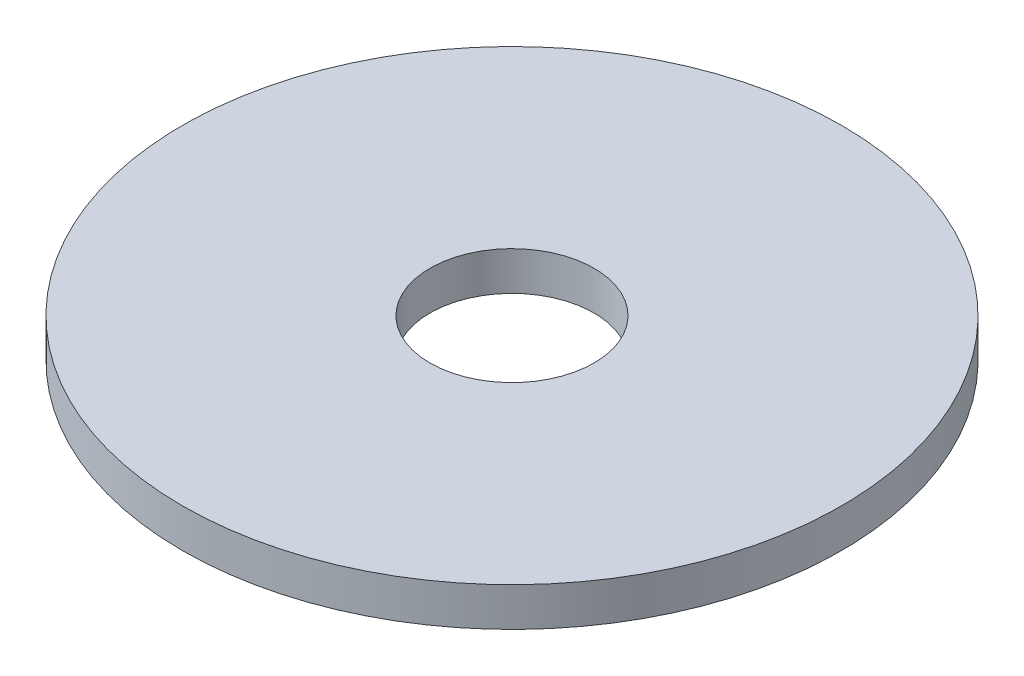
ISO-10303-21;
HEADER;
FILE_DESCRIPTION(('STEP AP214'),'2;1');
FILE_NAME('part.step','',(''),(''),'','','');
FILE_SCHEMA(('AUTOMOTIVE_DESIGN { 1 0 10303 214 1 1 1 1 }'));
ENDSEC;
DATA;
#1=APPLICATION_CONTEXT('core data for automotive mechanical design processes');
#2=APPLICATION_PROTOCOL_DEFINITION('international standard','automotive_design',2000,#1);
#3=PRODUCT_CONTEXT('',#1,'mechanical');
#4=PRODUCT('Part','Part','',(#3));
#5=PRODUCT_RELATED_PRODUCT_CATEGORY('part','',(#4));
#6=PRODUCT_DEFINITION_FORMATION('','',#4);
#7=PRODUCT_DEFINITION_CONTEXT('part definition',#1,'design');
#8=PRODUCT_DEFINITION('design','',#6,#7);
#9=PRODUCT_DEFINITION_SHAPE('','',#8);
#10=(LENGTH_UNIT() NAMED_UNIT(*) SI_UNIT(.MILLI.,.METRE.));
#11=(NAMED_UNIT(*) PLANE_ANGLE_UNIT() SI_UNIT($,.RADIAN.));
#12=(NAMED_UNIT(*) SI_UNIT($,.STERADIAN.) SOLID_ANGLE_UNIT());
#13=UNCERTAINTY_MEASURE_WITH_UNIT(LENGTH_MEASURE(1.E-05),#10,'distance_accuracy_value','');
#14=(GEOMETRIC_REPRESENTATION_CONTEXT(3) GLOBAL_UNCERTAINTY_ASSIGNED_CONTEXT((#13)) GLOBAL_UNIT_ASSIGNED_CONTEXT((#10,
#11,#12)) REPRESENTATION_CONTEXT('',''));
#15=CARTESIAN_POINT('',(0.,0.,0.));
#16=DIRECTION('',(0.,0.,1.));
#17=DIRECTION('',(1.,0.,0.));
#18=AXIS2_PLACEMENT_3D('',#15,#16,#17);
#19=CARTESIAN_POINT('',(0.,1.5,0.));
#20=DIRECTION('',(0.,1.,0.));
#21=DIRECTION('',(0.,0.,1.));
#22=AXIS2_PLACEMENT_3D('',#19,#20,#21);
#23=PLANE('',#22);
#24=CARTESIAN_POINT('',(0.,1.5,0.));
#25=DIRECTION('',(0.,1.,0.));
#26=DIRECTION('',(0.,0.,1.));
#27=AXIS2_PLACEMENT_3D('',#24,#25,#26);
#28=CIRCLE('',#27,12.75);
#29=CARTESIAN_POINT('',(0.,1.5,12.75));
#30=VERTEX_POINT('',#29);
#31=EDGE_CURVE('E10',#30,#30,#28,.T.);
#32=ORIENTED_EDGE('',*,*,#31,.T.);
#33=EDGE_LOOP('',(#32));
#34=FACE_BOUND('',#33,.T.);
#35=CARTESIAN_POINT('',(0.,1.5,0.));
#36=DIRECTION('',(0.,1.,0.));
#37=DIRECTION('',(0.,0.,1.));
#38=AXIS2_PLACEMENT_3D('',#35,#36,#37);
#39=CIRCLE('',#38,3.175);
#40=CARTESIAN_POINT('',(0.,1.5,3.175));
#41=VERTEX_POINT('',#40);
#42=EDGE_CURVE('E50',#41,#41,#39,.T.);
#43=ORIENTED_EDGE('',*,*,#42,.F.);
#44=EDGE_LOOP('',(#43));
#45=FACE_BOUND('',#44,.T.);
#46=ADVANCED_FACE('F37',(#34,#45),#23,.T.);
#47=CARTESIAN_POINT('',(0.,0.,0.));
#48=DIRECTION('',(0.,1.,0.));
#49=DIRECTION('',(0.,0.,1.));
#50=AXIS2_PLACEMENT_3D('',#47,#48,#49);
#51=PLANE('',#50);
#52=CARTESIAN_POINT('',(0.,0.,0.));
#53=DIRECTION('',(0.,1.,0.));
#54=DIRECTION('',(0.,0.,1.));
#55=AXIS2_PLACEMENT_3D('',#52,#53,#54);
#56=CIRCLE('',#55,12.75);
#57=CARTESIAN_POINT('',(0.,0.,12.75));
#58=VERTEX_POINT('',#57);
#59=EDGE_CURVE('E41',#58,#58,#56,.T.);
#60=ORIENTED_EDGE('',*,*,#59,.F.);
#61=EDGE_LOOP('',(#60));
#62=FACE_BOUND('',#61,.T.);
#63=CARTESIAN_POINT('',(0.,0.,0.));
#64=DIRECTION('',(0.,1.,0.));
#65=DIRECTION('',(0.,0.,1.));
#66=AXIS2_PLACEMENT_3D('',#63,#64,#65);
#67=CIRCLE('',#66,3.175);
#68=CARTESIAN_POINT('',(0.,0.,3.175));
#69=VERTEX_POINT('',#68);
#70=EDGE_CURVE('E52',#69,#69,#67,.T.);
#71=ORIENTED_EDGE('',*,*,#70,.T.);
#72=EDGE_LOOP('',(#71));
#73=FACE_BOUND('',#72,.T.);
#74=ADVANCED_FACE('F64',(#62,#73),#51,.F.);
#75=CARTESIAN_POINT('',(0.,1.5,0.));
#76=DIRECTION('',(0.,-1.,0.));
#77=DIRECTION('',(0.,0.,-1.));
#78=AXIS2_PLACEMENT_3D('',#75,#76,#77);
#79=CYLINDRICAL_SURFACE('',#78,12.75);
#80=ORIENTED_EDGE('',*,*,#31,.F.);
#81=EDGE_LOOP('',(#80));
#82=FACE_BOUND('',#81,.T.);
#83=ORIENTED_EDGE('',*,*,#59,.T.);
#84=EDGE_LOOP('',(#83));
#85=FACE_BOUND('',#84,.T.);
#86=ADVANCED_FACE('F39',(#82,#85),#79,.T.);
#87=CARTESIAN_POINT('',(0.,1.5,0.));
#88=DIRECTION('',(0.,-1.,0.));
#89=DIRECTION('',(0.,0.,-1.));
#90=AXIS2_PLACEMENT_3D('',#87,#88,#89);
#91=CYLINDRICAL_SURFACE('',#90,3.175);
#92=ORIENTED_EDGE('',*,*,#42,.T.);
#93=EDGE_LOOP('',(#92));
#94=FACE_BOUND('',#93,.T.);
#95=ORIENTED_EDGE('',*,*,#70,.F.);
#96=EDGE_LOOP('',(#95));
#97=FACE_BOUND('',#96,.T.);
#98=ADVANCED_FACE('F60',(#94,#97),#91,.F.);
#99=CLOSED_SHELL('',(#46,#74,#86,#98));
#100=MANIFOLD_SOLID_BREP('B2',#99);
#101=ADVANCED_BREP_SHAPE_REPRESENTATION('',(#18,#100),#14);
#102=SHAPE_DEFINITION_REPRESENTATION(#9,#101);
ENDSEC;
END-ISO-10303-21;
